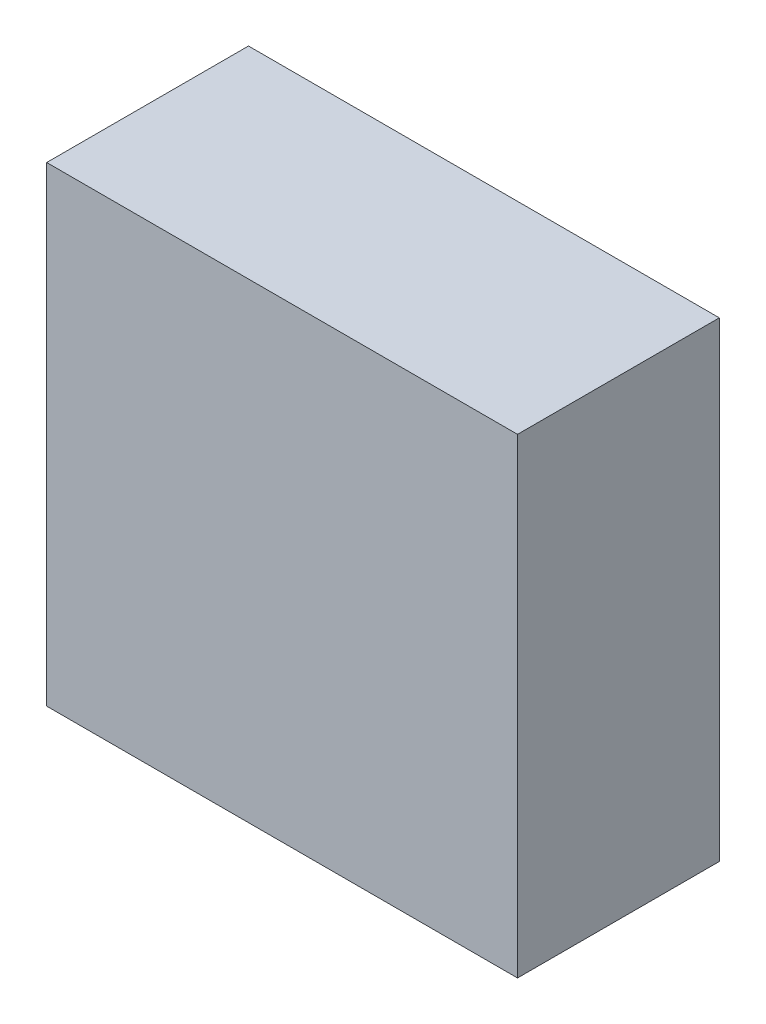
ISO-10303-21;
HEADER;
FILE_DESCRIPTION(('STEP AP214'),'2;1');
FILE_NAME('part.step','',(''),(''),'','','');
FILE_SCHEMA(('AUTOMOTIVE_DESIGN { 1 0 10303 214 1 1 1 1 }'));
ENDSEC;
DATA;
#1=APPLICATION_CONTEXT('core data for automotive mechanical design processes');
#2=APPLICATION_PROTOCOL_DEFINITION('international standard','automotive_design',2000,#1);
#3=PRODUCT_CONTEXT('',#1,'mechanical');
#4=PRODUCT('Part','Part','',(#3));
#5=PRODUCT_RELATED_PRODUCT_CATEGORY('part','',(#4));
#6=PRODUCT_DEFINITION_FORMATION('','',#4);
#7=PRODUCT_DEFINITION_CONTEXT('part definition',#1,'design');
#8=PRODUCT_DEFINITION('design','',#6,#7);
#9=PRODUCT_DEFINITION_SHAPE('','',#8);
#10=(LENGTH_UNIT() NAMED_UNIT(*) SI_UNIT(.MILLI.,.METRE.));
#11=(NAMED_UNIT(*) PLANE_ANGLE_UNIT() SI_UNIT($,.RADIAN.));
#12=(NAMED_UNIT(*) SI_UNIT($,.STERADIAN.) SOLID_ANGLE_UNIT());
#13=UNCERTAINTY_MEASURE_WITH_UNIT(LENGTH_MEASURE(1.E-05),#10,'distance_accuracy_value','');
#14=(GEOMETRIC_REPRESENTATION_CONTEXT(3) GLOBAL_UNCERTAINTY_ASSIGNED_CONTEXT((#13)) GLOBAL_UNIT_ASSIGNED_CONTEXT((#10,
#11,#12)) REPRESENTATION_CONTEXT('',''));
#15=CARTESIAN_POINT('',(0.,0.,0.));
#16=DIRECTION('',(0.,0.,1.));
#17=DIRECTION('',(1.,0.,0.));
#18=AXIS2_PLACEMENT_3D('',#15,#16,#17);
#19=CARTESIAN_POINT('',(7.,7.,6.));
#20=DIRECTION('',(-1.,0.,0.));
#21=DIRECTION('',(0.,0.,1.));
#22=AXIS2_PLACEMENT_3D('',#19,#20,#21);
#23=PLANE('',#22);
#24=DIRECTION('',(0.,1.,0.));
#25=VECTOR('',#24,1.);
#26=CARTESIAN_POINT('',(7.,7.,0.));
#27=LINE('',#26,#25);
#28=CARTESIAN_POINT('',(7.,-7.,0.));
#29=VERTEX_POINT('',#28);
#30=CARTESIAN_POINT('',(7.,7.,0.));
#31=VERTEX_POINT('',#30);
#32=EDGE_CURVE('E107',#29,#31,#27,.T.);
#33=ORIENTED_EDGE('',*,*,#32,.T.);
#34=DIRECTION('',(0.,0.,-1.));
#35=VECTOR('',#34,1.);
#36=CARTESIAN_POINT('',(7.,7.,6.));
#37=LINE('',#36,#35);
#38=CARTESIAN_POINT('',(7.,7.,6.));
#39=VERTEX_POINT('',#38);
#40=EDGE_CURVE('E11',#39,#31,#37,.T.);
#41=ORIENTED_EDGE('',*,*,#40,.F.);
#42=DIRECTION('',(0.,1.,0.));
#43=VECTOR('',#42,1.);
#44=CARTESIAN_POINT('',(7.,7.,6.));
#45=LINE('',#44,#43);
#46=CARTESIAN_POINT('',(7.,-7.,6.));
#47=VERTEX_POINT('',#46);
#48=EDGE_CURVE('E91',#47,#39,#45,.T.);
#49=ORIENTED_EDGE('',*,*,#48,.F.);
#50=DIRECTION('',(0.,0.,-1.));
#51=VECTOR('',#50,1.);
#52=CARTESIAN_POINT('',(7.,-7.,6.));
#53=LINE('',#52,#51);
#54=EDGE_CURVE('E103',#47,#29,#53,.T.);
#55=ORIENTED_EDGE('',*,*,#54,.T.);
#56=EDGE_LOOP('',(#33,#41,#49,#55));
#57=FACE_BOUND('',#56,.T.);
#58=ADVANCED_FACE('F39',(#57),#23,.F.);
#59=CARTESIAN_POINT('',(-7.,7.,6.));
#60=DIRECTION('',(0.,-1.,0.));
#61=DIRECTION('',(0.,0.,-1.));
#62=AXIS2_PLACEMENT_3D('',#59,#60,#61);
#63=PLANE('',#62);
#64=DIRECTION('',(-1.,0.,0.));
#65=VECTOR('',#64,1.);
#66=CARTESIAN_POINT('',(-7.,7.,0.));
#67=LINE('',#66,#65);
#68=CARTESIAN_POINT('',(-7.,7.,0.));
#69=VERTEX_POINT('',#68);
#70=EDGE_CURVE('E96',#31,#69,#67,.T.);
#71=ORIENTED_EDGE('',*,*,#70,.T.);
#72=DIRECTION('',(0.,0.,-1.));
#73=VECTOR('',#72,1.);
#74=CARTESIAN_POINT('',(-7.,7.,6.));
#75=LINE('',#74,#73);
#76=CARTESIAN_POINT('',(-7.,7.,6.));
#77=VERTEX_POINT('',#76);
#78=EDGE_CURVE('E48',#77,#69,#75,.T.);
#79=ORIENTED_EDGE('',*,*,#78,.F.);
#80=DIRECTION('',(-1.,0.,0.));
#81=VECTOR('',#80,1.);
#82=CARTESIAN_POINT('',(-7.,7.,6.));
#83=LINE('',#82,#81);
#84=EDGE_CURVE('E86',#39,#77,#83,.T.);
#85=ORIENTED_EDGE('',*,*,#84,.F.);
#86=ORIENTED_EDGE('',*,*,#40,.T.);
#87=EDGE_LOOP('',(#71,#79,#85,#86));
#88=FACE_BOUND('',#87,.T.);
#89=ADVANCED_FACE('F95',(#88),#63,.F.);
#90=CARTESIAN_POINT('',(-7.,7.,6.));
#91=DIRECTION('',(1.,0.,0.));
#92=DIRECTION('',(0.,1.,0.));
#93=AXIS2_PLACEMENT_3D('',#90,#91,#92);
#94=PLANE('',#93);
#95=DIRECTION('',(0.,-1.,0.));
#96=VECTOR('',#95,1.);
#97=CARTESIAN_POINT('',(-7.,7.,0.));
#98=LINE('',#97,#96);
#99=CARTESIAN_POINT('',(-7.,-7.,0.));
#100=VERTEX_POINT('',#99);
#101=EDGE_CURVE('E73',#69,#100,#98,.T.);
#102=ORIENTED_EDGE('',*,*,#101,.T.);
#103=DIRECTION('',(0.,0.,-1.));
#104=VECTOR('',#103,1.);
#105=CARTESIAN_POINT('',(-7.,-7.,6.));
#106=LINE('',#105,#104);
#107=CARTESIAN_POINT('',(-7.,-7.,6.));
#108=VERTEX_POINT('',#107);
#109=EDGE_CURVE('E98',#108,#100,#106,.T.);
#110=ORIENTED_EDGE('',*,*,#109,.F.);
#111=DIRECTION('',(0.,-1.,0.));
#112=VECTOR('',#111,1.);
#113=CARTESIAN_POINT('',(-7.,7.,6.));
#114=LINE('',#113,#112);
#115=EDGE_CURVE('E89',#77,#108,#114,.T.);
#116=ORIENTED_EDGE('',*,*,#115,.F.);
#117=ORIENTED_EDGE('',*,*,#78,.T.);
#118=EDGE_LOOP('',(#102,#110,#116,#117));
#119=FACE_BOUND('',#118,.T.);
#120=ADVANCED_FACE('F99',(#119),#94,.F.);
#121=CARTESIAN_POINT('',(-7.,-7.,6.));
#122=DIRECTION('',(0.,1.,0.));
#123=DIRECTION('',(0.,0.,1.));
#124=AXIS2_PLACEMENT_3D('',#121,#122,#123);
#125=PLANE('',#124);
#126=DIRECTION('',(1.,0.,0.));
#127=VECTOR('',#126,1.);
#128=CARTESIAN_POINT('',(-7.,-7.,0.));
#129=LINE('',#128,#127);
#130=EDGE_CURVE('E79',#100,#29,#129,.T.);
#131=ORIENTED_EDGE('',*,*,#130,.T.);
#132=ORIENTED_EDGE('',*,*,#54,.F.);
#133=DIRECTION('',(1.,0.,0.));
#134=VECTOR('',#133,1.);
#135=CARTESIAN_POINT('',(-7.,-7.,6.));
#136=LINE('',#135,#134);
#137=EDGE_CURVE('E56',#108,#47,#136,.T.);
#138=ORIENTED_EDGE('',*,*,#137,.F.);
#139=ORIENTED_EDGE('',*,*,#109,.T.);
#140=EDGE_LOOP('',(#131,#132,#138,#139));
#141=FACE_BOUND('',#140,.T.);
#142=ADVANCED_FACE('F120',(#141),#125,.F.);
#143=CARTESIAN_POINT('',(0.,0.,6.));
#144=DIRECTION('',(0.,0.,1.));
#145=DIRECTION('',(1.,0.,0.));
#146=AXIS2_PLACEMENT_3D('',#143,#144,#145);
#147=PLANE('',#146);
#148=ORIENTED_EDGE('',*,*,#48,.T.);
#149=ORIENTED_EDGE('',*,*,#84,.T.);
#150=ORIENTED_EDGE('',*,*,#115,.T.);
#151=ORIENTED_EDGE('',*,*,#137,.T.);
#152=EDGE_LOOP('',(#148,#149,#150,#151));
#153=FACE_BOUND('',#152,.T.);
#154=ADVANCED_FACE('F87',(#153),#147,.T.);
#155=CARTESIAN_POINT('',(0.,0.,0.));
#156=DIRECTION('',(0.,0.,1.));
#157=DIRECTION('',(1.,0.,0.));
#158=AXIS2_PLACEMENT_3D('',#155,#156,#157);
#159=PLANE('',#158);
#160=ORIENTED_EDGE('',*,*,#32,.F.);
#161=ORIENTED_EDGE('',*,*,#130,.F.);
#162=ORIENTED_EDGE('',*,*,#101,.F.);
#163=ORIENTED_EDGE('',*,*,#70,.F.);
#164=EDGE_LOOP('',(#160,#161,#162,#163));
#165=FACE_BOUND('',#164,.T.);
#166=ADVANCED_FACE('F123',(#165),#159,.F.);
#167=CLOSED_SHELL('',(#58,#89,#120,#142,#154,#166));
#168=MANIFOLD_SOLID_BREP('B2',#167);
#169=ADVANCED_BREP_SHAPE_REPRESENTATION('',(#18,#168),#14);
#170=SHAPE_DEFINITION_REPRESENTATION(#9,#169);
ENDSEC;
END-ISO-10303-21;
